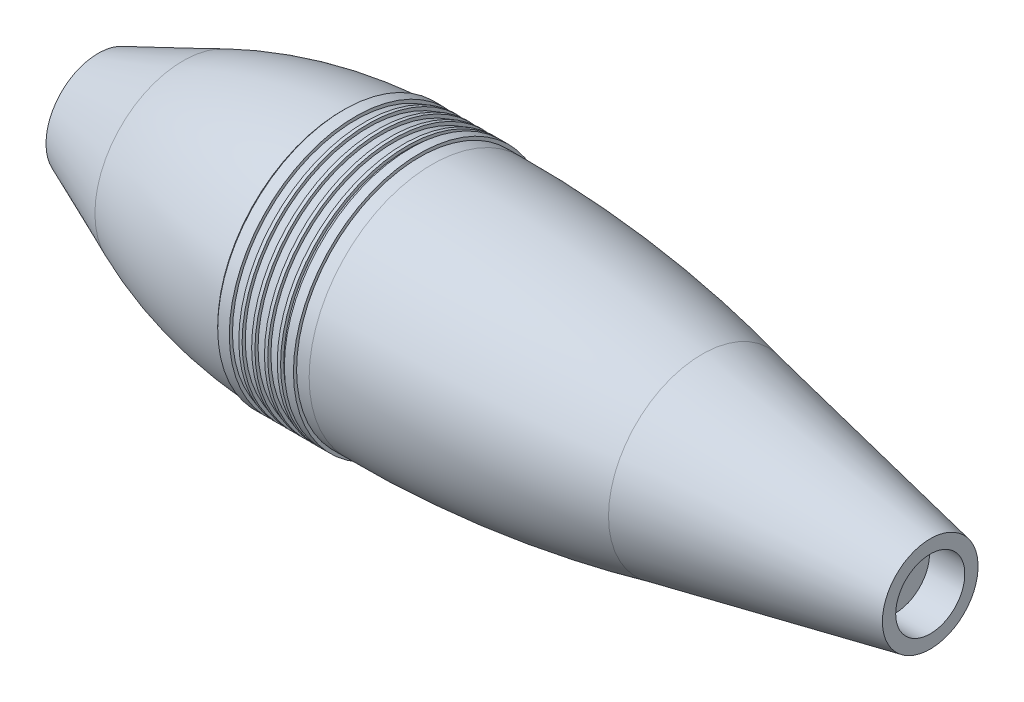
ISO-10303-21;
HEADER;
FILE_DESCRIPTION(('STEP AP214'),'2;1');
FILE_NAME('part.step','',(''),(''),'','','');
FILE_SCHEMA(('AUTOMOTIVE_DESIGN { 1 0 10303 214 1 1 1 1 }'));
ENDSEC;
DATA;
#1=APPLICATION_CONTEXT('core data for automotive mechanical design processes');
#2=APPLICATION_PROTOCOL_DEFINITION('international standard','automotive_design',2000,#1);
#3=PRODUCT_CONTEXT('',#1,'mechanical');
#4=PRODUCT('Part','Part','',(#3));
#5=PRODUCT_RELATED_PRODUCT_CATEGORY('part','',(#4));
#6=PRODUCT_DEFINITION_FORMATION('','',#4);
#7=PRODUCT_DEFINITION_CONTEXT('part definition',#1,'design');
#8=PRODUCT_DEFINITION('design','',#6,#7);
#9=PRODUCT_DEFINITION_SHAPE('','',#8);
#10=(LENGTH_UNIT() NAMED_UNIT(*) SI_UNIT(.MILLI.,.METRE.));
#11=(NAMED_UNIT(*) PLANE_ANGLE_UNIT() SI_UNIT($,.RADIAN.));
#12=(NAMED_UNIT(*) SI_UNIT($,.STERADIAN.) SOLID_ANGLE_UNIT());
#13=UNCERTAINTY_MEASURE_WITH_UNIT(LENGTH_MEASURE(1.E-05),#10,'distance_accuracy_value','');
#14=(GEOMETRIC_REPRESENTATION_CONTEXT(3) GLOBAL_UNCERTAINTY_ASSIGNED_CONTEXT((#13)) GLOBAL_UNIT_ASSIGNED_CONTEXT((#10,
#11,#12)) REPRESENTATION_CONTEXT('',''));
#15=CARTESIAN_POINT('',(0.,0.,0.));
#16=DIRECTION('',(0.,0.,1.));
#17=DIRECTION('',(1.,0.,0.));
#18=AXIS2_PLACEMENT_3D('',#15,#16,#17);
#19=CARTESIAN_POINT('',(-198.645,24.89,0.));
#20=DIRECTION('',(1.,0.,0.));
#21=DIRECTION('',(0.,0.,-1.));
#22=AXIS2_PLACEMENT_3D('',#19,#20,#21);
#23=PLANE('',#22);
#24=CARTESIAN_POINT('',(-198.645,0.,0.));
#25=DIRECTION('',(-1.,0.,0.));
#26=DIRECTION('',(0.,0.,1.));
#27=AXIS2_PLACEMENT_3D('',#24,#25,#26);
#28=CIRCLE('',#27,14.5);
#29=CARTESIAN_POINT('',(-198.645,0.,14.5));
#30=VERTEX_POINT('',#29);
#31=EDGE_CURVE('E10',#30,#30,#28,.T.);
#32=ORIENTED_EDGE('',*,*,#31,.F.);
#33=EDGE_LOOP('',(#32));
#34=FACE_BOUND('',#33,.T.);
#35=CARTESIAN_POINT('',(-198.645,0.,0.));
#36=DIRECTION('',(-1.,0.,0.));
#37=DIRECTION('',(0.,0.,1.));
#38=AXIS2_PLACEMENT_3D('',#35,#36,#37);
#39=CIRCLE('',#38,24.89);
#40=CARTESIAN_POINT('',(-198.645,0.,24.89));
#41=VERTEX_POINT('',#40);
#42=EDGE_CURVE('E139',#41,#41,#39,.T.);
#43=ORIENTED_EDGE('',*,*,#42,.T.);
#44=EDGE_LOOP('',(#43));
#45=FACE_BOUND('',#44,.T.);
#46=ADVANCED_FACE('F30',(#34,#45),#23,.F.);
#47=CARTESIAN_POINT('',(-198.645,0.,0.));
#48=DIRECTION('',(-1.,0.,0.));
#49=DIRECTION('',(0.,0.,1.));
#50=AXIS2_PLACEMENT_3D('',#47,#48,#49);
#51=CYLINDRICAL_SURFACE('',#50,14.5);
#52=CARTESIAN_POINT('',(-182.645,0.,0.));
#53=DIRECTION('',(-1.,0.,0.));
#54=DIRECTION('',(0.,0.,1.));
#55=AXIS2_PLACEMENT_3D('',#52,#53,#54);
#56=CIRCLE('',#55,14.5);
#57=CARTESIAN_POINT('',(-182.645,0.,14.5));
#58=VERTEX_POINT('',#57);
#59=EDGE_CURVE('E36',#58,#58,#56,.T.);
#60=ORIENTED_EDGE('',*,*,#59,.F.);
#61=EDGE_LOOP('',(#60));
#62=FACE_BOUND('',#61,.T.);
#63=ORIENTED_EDGE('',*,*,#31,.T.);
#64=EDGE_LOOP('',(#63));
#65=FACE_BOUND('',#64,.T.);
#66=ADVANCED_FACE('F305',(#62,#65),#51,.F.);
#67=CARTESIAN_POINT('',(-182.645,14.5,0.));
#68=DIRECTION('',(-1.,0.,0.));
#69=DIRECTION('',(0.,0.,1.));
#70=AXIS2_PLACEMENT_3D('',#67,#68,#69);
#71=PLANE('',#70);
#72=CARTESIAN_POINT('',(-182.645,0.,0.));
#73=DIRECTION('',(-1.,0.,0.));
#74=DIRECTION('',(0.,0.,1.));
#75=AXIS2_PLACEMENT_3D('',#72,#73,#74);
#76=CIRCLE('',#75,17.3451284403013);
#77=CARTESIAN_POINT('',(-182.645,0.,17.3451284403013));
#78=VERTEX_POINT('',#77);
#79=EDGE_CURVE('E40',#78,#78,#76,.T.);
#80=ORIENTED_EDGE('',*,*,#79,.F.);
#81=EDGE_LOOP('',(#80));
#82=FACE_BOUND('',#81,.T.);
#83=ORIENTED_EDGE('',*,*,#59,.T.);
#84=EDGE_LOOP('',(#83));
#85=FACE_BOUND('',#84,.T.);
#86=ADVANCED_FACE('F310',(#82,#85),#71,.F.);
#87=CARTESIAN_POINT('',(-180.445,0.,0.));
#88=DIRECTION('',(-1.,0.,0.));
#89=DIRECTION('',(0.,0.,1.));
#90=AXIS2_PLACEMENT_3D('',#87,#88,#89);
#91=TOROIDAL_SURFACE('',#90,17.3451284403013,2.20000000000001);
#92=CARTESIAN_POINT('',(-181.597791569387,0.,0.));
#93=DIRECTION('',(-1.,0.,0.));
#94=DIRECTION('',(0.,0.,1.));
#95=AXIS2_PLACEMENT_3D('',#92,#93,#94);
#96=CIRCLE('',#95,19.2189138062254);
#97=CARTESIAN_POINT('',(-181.597791569387,0.,19.2189138062254));
#98=VERTEX_POINT('',#97);
#99=EDGE_CURVE('E44',#98,#98,#96,.T.);
#100=ORIENTED_EDGE('',*,*,#99,.F.);
#101=EDGE_LOOP('',(#100));
#102=FACE_BOUND('',#101,.T.);
#103=ORIENTED_EDGE('',*,*,#79,.T.);
#104=EDGE_LOOP('',(#103));
#105=FACE_BOUND('',#104,.T.);
#106=ADVANCED_FACE('F315',(#102,#105),#91,.F.);
#107=CARTESIAN_POINT('',(-81.1844059141401,0.,0.));
#108=DIRECTION('',(-1.,0.,0.));
#109=DIRECTION('',(0.,0.,1.));
#110=AXIS2_PLACEMENT_3D('',#107,#108,#109);
#111=DEGENERATE_TOROIDAL_SURFACE('',#110,143.996308771973,191.63,.F.);
#112=CARTESIAN_POINT('',(-79.995,0.,0.));
#113=DIRECTION('',(-1.,0.,0.));
#114=DIRECTION('',(0.,0.,1.));
#115=AXIS2_PLACEMENT_3D('',#112,#113,#114);
#116=CIRCLE('',#115,47.63);
#117=CARTESIAN_POINT('',(-79.995,0.,47.63));
#118=VERTEX_POINT('',#117);
#119=EDGE_CURVE('E49',#118,#118,#116,.T.);
#120=ORIENTED_EDGE('',*,*,#119,.F.);
#121=EDGE_LOOP('',(#120));
#122=FACE_BOUND('',#121,.T.);
#123=ORIENTED_EDGE('',*,*,#99,.T.);
#124=EDGE_LOOP('',(#123));
#125=FACE_BOUND('',#124,.T.);
#126=ADVANCED_FACE('F321',(#122,#125),#111,.T.);
#127=CARTESIAN_POINT('',(-198.645,0.,0.));
#128=DIRECTION('',(-1.,0.,0.));
#129=DIRECTION('',(0.,0.,1.));
#130=AXIS2_PLACEMENT_3D('',#127,#128,#129);
#131=CYLINDRICAL_SURFACE('',#130,47.63);
#132=CARTESIAN_POINT('',(-10.775,0.,0.));
#133=DIRECTION('',(-1.,0.,0.));
#134=DIRECTION('',(0.,0.,1.));
#135=AXIS2_PLACEMENT_3D('',#132,#133,#134);
#136=CIRCLE('',#135,47.6300000000001);
#137=CARTESIAN_POINT('',(-10.775,0.,47.6300000000001));
#138=VERTEX_POINT('',#137);
#139=EDGE_CURVE('E52',#138,#138,#136,.T.);
#140=ORIENTED_EDGE('',*,*,#139,.F.);
#141=EDGE_LOOP('',(#140));
#142=FACE_BOUND('',#141,.T.);
#143=ORIENTED_EDGE('',*,*,#119,.T.);
#144=EDGE_LOOP('',(#143));
#145=FACE_BOUND('',#144,.T.);
#146=ADVANCED_FACE('F325',(#142,#145),#131,.F.);
#147=CARTESIAN_POINT('',(-30.7217353090551,0.,0.));
#148=DIRECTION('',(-1.,0.,0.));
#149=DIRECTION('',(0.,0.,1.));
#150=AXIS2_PLACEMENT_3D('',#147,#148,#149);
#151=DEGENERATE_TOROIDAL_SURFACE('',#150,576.161166858357,624.11,.F.);
#152=CARTESIAN_POINT('',(89.705,0.,0.));
#153=DIRECTION('',(-1.,0.,0.));
#154=DIRECTION('',(0.,0.,1.));
#155=AXIS2_PLACEMENT_3D('',#152,#153,#154);
#156=CIRCLE('',#155,36.22);
#157=CARTESIAN_POINT('',(89.705,0.,36.22));
#158=VERTEX_POINT('',#157);
#159=EDGE_CURVE('E55',#158,#158,#156,.T.);
#160=ORIENTED_EDGE('',*,*,#159,.F.);
#161=EDGE_LOOP('',(#160));
#162=FACE_BOUND('',#161,.T.);
#163=ORIENTED_EDGE('',*,*,#139,.T.);
#164=EDGE_LOOP('',(#163));
#165=FACE_BOUND('',#164,.T.);
#166=ADVANCED_FACE('F329',(#162,#165),#151,.T.);
#167=CARTESIAN_POINT('',(89.705,0.,0.));
#168=DIRECTION('',(-1.,0.,0.));
#169=DIRECTION('',(0.,0.,1.));
#170=AXIS2_PLACEMENT_3D('',#167,#168,#169);
#171=CONICAL_SURFACE('',#170,36.22,0.235452955616675);
#172=CARTESIAN_POINT('',(164.237834674445,0.,0.));
#173=DIRECTION('',(-1.,0.,0.));
#174=DIRECTION('',(0.,0.,1.));
#175=AXIS2_PLACEMENT_3D('',#172,#173,#174);
#176=CIRCLE('',#175,18.3393734819945);
#177=CARTESIAN_POINT('',(164.237834674445,0.,18.3393734819945));
#178=VERTEX_POINT('',#177);
#179=EDGE_CURVE('E58',#178,#178,#176,.T.);
#180=ORIENTED_EDGE('',*,*,#179,.F.);
#181=EDGE_LOOP('',(#180));
#182=FACE_BOUND('',#181,.T.);
#183=ORIENTED_EDGE('',*,*,#159,.T.);
#184=EDGE_LOOP('',(#183));
#185=FACE_BOUND('',#184,.T.);
#186=ADVANCED_FACE('F333',(#182,#185),#171,.F.);
#187=CARTESIAN_POINT('',(161.905,0.,0.));
#188=DIRECTION('',(-1.,0.,0.));
#189=DIRECTION('',(0.,0.,1.));
#190=AXIS2_PLACEMENT_3D('',#187,#188,#189);
#191=DEGENERATE_TOROIDAL_SURFACE('',#190,8.61528574166081,10.,.T.);
#192=CARTESIAN_POINT('',(171.905,0.,0.));
#193=DIRECTION('',(-1.,0.,0.));
#194=DIRECTION('',(0.,0.,1.));
#195=AXIS2_PLACEMENT_3D('',#192,#193,#194);
#196=CIRCLE('',#195,8.61528574166075);
#197=CARTESIAN_POINT('',(171.905,0.,8.61528574166075));
#198=VERTEX_POINT('',#197);
#199=EDGE_CURVE('E61',#198,#198,#196,.T.);
#200=ORIENTED_EDGE('',*,*,#199,.F.);
#201=EDGE_LOOP('',(#200));
#202=FACE_BOUND('',#201,.T.);
#203=ORIENTED_EDGE('',*,*,#179,.T.);
#204=EDGE_LOOP('',(#203));
#205=FACE_BOUND('',#204,.T.);
#206=ADVANCED_FACE('F301',(#202,#205),#191,.F.);
#207=CARTESIAN_POINT('',(171.905,0.,0.));
#208=DIRECTION('',(1.,0.,0.));
#209=DIRECTION('',(0.,0.,-1.));
#210=AXIS2_PLACEMENT_3D('',#207,#208,#209);
#211=PLANE('',#210);
#212=ORIENTED_EDGE('',*,*,#199,.T.);
#213=EDGE_LOOP('',(#212));
#214=FACE_BOUND('',#213,.T.);
#215=ADVANCED_FACE('F296',(#214),#211,.F.);
#216=CARTESIAN_POINT('',(181.815,16.5,0.));
#217=DIRECTION('',(-1.,0.,0.));
#218=DIRECTION('',(0.,0.,1.));
#219=AXIS2_PLACEMENT_3D('',#216,#217,#218);
#220=PLANE('',#219);
#221=CARTESIAN_POINT('',(181.815,0.,0.));
#222=DIRECTION('',(-1.,0.,0.));
#223=DIRECTION('',(0.,0.,1.));
#224=AXIS2_PLACEMENT_3D('',#221,#222,#223);
#225=CIRCLE('',#224,16.5);
#226=CARTESIAN_POINT('',(181.815,0.,16.5));
#227=VERTEX_POINT('',#226);
#228=EDGE_CURVE('E64',#227,#227,#225,.T.);
#229=ORIENTED_EDGE('',*,*,#228,.F.);
#230=EDGE_LOOP('',(#229));
#231=FACE_BOUND('',#230,.T.);
#232=ADVANCED_FACE('F291',(#231),#220,.F.);
#233=CARTESIAN_POINT('',(-198.645,0.,0.));
#234=DIRECTION('',(-1.,0.,0.));
#235=DIRECTION('',(0.,0.,1.));
#236=AXIS2_PLACEMENT_3D('',#233,#234,#235);
#237=CYLINDRICAL_SURFACE('',#236,16.5);
#238=CARTESIAN_POINT('',(198.645,0.,0.));
#239=DIRECTION('',(-1.,0.,0.));
#240=DIRECTION('',(0.,0.,1.));
#241=AXIS2_PLACEMENT_3D('',#238,#239,#240);
#242=CIRCLE('',#241,16.5);
#243=CARTESIAN_POINT('',(198.645,0.,16.5));
#244=VERTEX_POINT('',#243);
#245=EDGE_CURVE('E67',#244,#244,#242,.T.);
#246=ORIENTED_EDGE('',*,*,#245,.F.);
#247=EDGE_LOOP('',(#246));
#248=FACE_BOUND('',#247,.T.);
#249=ORIENTED_EDGE('',*,*,#228,.T.);
#250=EDGE_LOOP('',(#249));
#251=FACE_BOUND('',#250,.T.);
#252=ADVANCED_FACE('F285',(#248,#251),#237,.F.);
#253=CARTESIAN_POINT('',(198.645,22.84,0.));
#254=DIRECTION('',(-1.,0.,0.));
#255=DIRECTION('',(0.,0.,1.));
#256=AXIS2_PLACEMENT_3D('',#253,#254,#255);
#257=PLANE('',#256);
#258=CARTESIAN_POINT('',(198.645,0.,0.));
#259=DIRECTION('',(-1.,0.,0.));
#260=DIRECTION('',(0.,0.,1.));
#261=AXIS2_PLACEMENT_3D('',#258,#259,#260);
#262=CIRCLE('',#261,22.84);
#263=CARTESIAN_POINT('',(198.645,0.,22.84));
#264=VERTEX_POINT('',#263);
#265=EDGE_CURVE('E70',#264,#264,#262,.T.);
#266=ORIENTED_EDGE('',*,*,#265,.F.);
#267=EDGE_LOOP('',(#266));
#268=FACE_BOUND('',#267,.T.);
#269=ORIENTED_EDGE('',*,*,#245,.T.);
#270=EDGE_LOOP('',(#269));
#271=FACE_BOUND('',#270,.T.);
#272=ADVANCED_FACE('F279',(#268,#271),#257,.F.);
#273=CARTESIAN_POINT('',(198.645,0.,0.));
#274=DIRECTION('',(-1.,0.,0.));
#275=DIRECTION('',(0.,0.,1.));
#276=AXIS2_PLACEMENT_3D('',#273,#274,#275);
#277=CONICAL_SURFACE('',#276,22.84,0.197766237466921);
#278=CARTESIAN_POINT('',(89.705,0.,0.));
#279=DIRECTION('',(-1.,0.,0.));
#280=DIRECTION('',(0.,0.,1.));
#281=AXIS2_PLACEMENT_3D('',#278,#279,#280);
#282=CIRCLE('',#281,44.67);
#283=CARTESIAN_POINT('',(89.705,0.,44.67));
#284=VERTEX_POINT('',#283);
#285=EDGE_CURVE('E73',#284,#284,#282,.T.);
#286=ORIENTED_EDGE('',*,*,#285,.F.);
#287=EDGE_LOOP('',(#286));
#288=FACE_BOUND('',#287,.T.);
#289=ORIENTED_EDGE('',*,*,#265,.T.);
#290=EDGE_LOOP('',(#289));
#291=FACE_BOUND('',#290,.T.);
#292=ADVANCED_FACE('F273',(#288,#291),#277,.T.);
#293=CARTESIAN_POINT('',(-35.254257253578,0.,0.));
#294=DIRECTION('',(-1.,0.,0.));
#295=DIRECTION('',(0.,0.,1.));
#296=AXIS2_PLACEMENT_3D('',#293,#294,#295);
#297=DEGENERATE_TOROIDAL_SURFACE('',#296,501.661563820574,560.44,.F.);
#298=CARTESIAN_POINT('',(-39.135,0.,0.));
#299=DIRECTION('',(-1.,0.,0.));
#300=DIRECTION('',(0.,0.,1.));
#301=AXIS2_PLACEMENT_3D('',#298,#299,#300);
#302=CIRCLE('',#301,58.765);
#303=CARTESIAN_POINT('',(-39.135,0.,58.765));
#304=VERTEX_POINT('',#303);
#305=EDGE_CURVE('E76',#304,#304,#302,.T.);
#306=ORIENTED_EDGE('',*,*,#305,.F.);
#307=EDGE_LOOP('',(#306));
#308=FACE_BOUND('',#307,.T.);
#309=ORIENTED_EDGE('',*,*,#285,.T.);
#310=EDGE_LOOP('',(#309));
#311=FACE_BOUND('',#310,.T.);
#312=ADVANCED_FACE('F267',(#308,#311),#297,.F.);
#313=CARTESIAN_POINT('',(-198.645,0.,0.));
#314=DIRECTION('',(-1.,0.,0.));
#315=DIRECTION('',(0.,0.,1.));
#316=AXIS2_PLACEMENT_3D('',#313,#314,#315);
#317=CYLINDRICAL_SURFACE('',#316,58.765);
#318=CARTESIAN_POINT('',(-45.135,0.,0.));
#319=DIRECTION('',(-1.,0.,0.));
#320=DIRECTION('',(0.,0.,1.));
#321=AXIS2_PLACEMENT_3D('',#318,#319,#320);
#322=CIRCLE('',#321,58.765);
#323=CARTESIAN_POINT('',(-45.135,0.,58.765));
#324=VERTEX_POINT('',#323);
#325=EDGE_CURVE('E79',#324,#324,#322,.T.);
#326=ORIENTED_EDGE('',*,*,#325,.F.);
#327=EDGE_LOOP('',(#326));
#328=FACE_BOUND('',#327,.T.);
#329=ORIENTED_EDGE('',*,*,#305,.T.);
#330=EDGE_LOOP('',(#329));
#331=FACE_BOUND('',#330,.T.);
#332=ADVANCED_FACE('F261',(#328,#331),#317,.T.);
#333=CARTESIAN_POINT('',(-45.135,60.27,0.));
#334=DIRECTION('',(-1.,0.,0.));
#335=DIRECTION('',(0.,0.,1.));
#336=AXIS2_PLACEMENT_3D('',#333,#334,#335);
#337=PLANE('',#336);
#338=CARTESIAN_POINT('',(-45.135,0.,0.));
#339=DIRECTION('',(-1.,0.,0.));
#340=DIRECTION('',(0.,0.,1.));
#341=AXIS2_PLACEMENT_3D('',#338,#339,#340);
#342=CIRCLE('',#341,60.27);
#343=CARTESIAN_POINT('',(-45.135,0.,60.27));
#344=VERTEX_POINT('',#343);
#345=EDGE_CURVE('E82',#344,#344,#342,.T.);
#346=ORIENTED_EDGE('',*,*,#345,.F.);
#347=EDGE_LOOP('',(#346));
#348=FACE_BOUND('',#347,.T.);
#349=ORIENTED_EDGE('',*,*,#325,.T.);
#350=EDGE_LOOP('',(#349));
#351=FACE_BOUND('',#350,.T.);
#352=ADVANCED_FACE('F255',(#348,#351),#337,.F.);
#353=CARTESIAN_POINT('',(-198.645,0.,0.));
#354=DIRECTION('',(-1.,0.,0.));
#355=DIRECTION('',(0.,0.,1.));
#356=AXIS2_PLACEMENT_3D('',#353,#354,#355);
#357=CYLINDRICAL_SURFACE('',#356,60.27);
#358=CARTESIAN_POINT('',(-49.475,0.,0.));
#359=DIRECTION('',(-1.,0.,0.));
#360=DIRECTION('',(0.,0.,1.));
#361=AXIS2_PLACEMENT_3D('',#358,#359,#360);
#362=CIRCLE('',#361,60.27);
#363=CARTESIAN_POINT('',(-49.475,0.,60.27));
#364=VERTEX_POINT('',#363);
#365=EDGE_CURVE('E85',#364,#364,#362,.T.);
#366=ORIENTED_EDGE('',*,*,#365,.F.);
#367=EDGE_LOOP('',(#366));
#368=FACE_BOUND('',#367,.T.);
#369=ORIENTED_EDGE('',*,*,#345,.T.);
#370=EDGE_LOOP('',(#369));
#371=FACE_BOUND('',#370,.T.);
#372=ADVANCED_FACE('F249',(#368,#371),#357,.T.);
#373=CARTESIAN_POINT('',(-49.475,0.,0.));
#374=DIRECTION('',(1.,0.,0.));
#375=DIRECTION('',(0.,0.,-1.));
#376=AXIS2_PLACEMENT_3D('',#373,#374,#375);
#377=CONICAL_SURFACE('',#376,60.27,0.696375382510421);
#378=CARTESIAN_POINT('',(-51.275,0.,0.));
#379=DIRECTION('',(-1.,0.,0.));
#380=DIRECTION('',(0.,0.,1.));
#381=AXIS2_PLACEMENT_3D('',#378,#379,#380);
#382=CIRCLE('',#381,58.765);
#383=CARTESIAN_POINT('',(-51.275,0.,58.765));
#384=VERTEX_POINT('',#383);
#385=EDGE_CURVE('E88',#384,#384,#382,.T.);
#386=ORIENTED_EDGE('',*,*,#385,.F.);
#387=EDGE_LOOP('',(#386));
#388=FACE_BOUND('',#387,.T.);
#389=ORIENTED_EDGE('',*,*,#365,.T.);
#390=EDGE_LOOP('',(#389));
#391=FACE_BOUND('',#390,.T.);
#392=ADVANCED_FACE('F243',(#388,#391),#377,.T.);
#393=CARTESIAN_POINT('',(-51.275,60.27,0.));
#394=DIRECTION('',(-1.,0.,0.));
#395=DIRECTION('',(0.,0.,1.));
#396=AXIS2_PLACEMENT_3D('',#393,#394,#395);
#397=PLANE('',#396);
#398=CARTESIAN_POINT('',(-51.275,0.,0.));
#399=DIRECTION('',(-1.,0.,0.));
#400=DIRECTION('',(0.,0.,1.));
#401=AXIS2_PLACEMENT_3D('',#398,#399,#400);
#402=CIRCLE('',#401,60.27);
#403=CARTESIAN_POINT('',(-51.275,0.,60.27));
#404=VERTEX_POINT('',#403);
#405=EDGE_CURVE('E91',#404,#404,#402,.T.);
#406=ORIENTED_EDGE('',*,*,#405,.F.);
#407=EDGE_LOOP('',(#406));
#408=FACE_BOUND('',#407,.T.);
#409=ORIENTED_EDGE('',*,*,#385,.T.);
#410=EDGE_LOOP('',(#409));
#411=FACE_BOUND('',#410,.T.);
#412=ADVANCED_FACE('F237',(#408,#411),#397,.F.);
#413=CARTESIAN_POINT('',(-198.645,0.,0.));
#414=DIRECTION('',(-1.,0.,0.));
#415=DIRECTION('',(0.,0.,1.));
#416=AXIS2_PLACEMENT_3D('',#413,#414,#415);
#417=CYLINDRICAL_SURFACE('',#416,60.27);
#418=CARTESIAN_POINT('',(-52.855,0.,0.));
#419=DIRECTION('',(-1.,0.,0.));
#420=DIRECTION('',(0.,0.,1.));
#421=AXIS2_PLACEMENT_3D('',#418,#419,#420);
#422=CIRCLE('',#421,60.27);
#423=CARTESIAN_POINT('',(-52.855,0.,60.27));
#424=VERTEX_POINT('',#423);
#425=EDGE_CURVE('E94',#424,#424,#422,.T.);
#426=ORIENTED_EDGE('',*,*,#425,.F.);
#427=EDGE_LOOP('',(#426));
#428=FACE_BOUND('',#427,.T.);
#429=ORIENTED_EDGE('',*,*,#405,.T.);
#430=EDGE_LOOP('',(#429));
#431=FACE_BOUND('',#430,.T.);
#432=ADVANCED_FACE('F231',(#428,#431),#417,.T.);
#433=CARTESIAN_POINT('',(-52.855,0.,0.));
#434=DIRECTION('',(1.,0.,0.));
#435=DIRECTION('',(0.,0.,-1.));
#436=AXIS2_PLACEMENT_3D('',#433,#434,#435);
#437=CONICAL_SURFACE('',#436,60.27,0.32009766333992);
#438=CARTESIAN_POINT('',(-57.395,0.,0.));
#439=DIRECTION('',(-1.,0.,0.));
#440=DIRECTION('',(0.,0.,1.));
#441=AXIS2_PLACEMENT_3D('',#438,#439,#440);
#442=CIRCLE('',#441,58.765);
#443=CARTESIAN_POINT('',(-57.395,0.,58.765));
#444=VERTEX_POINT('',#443);
#445=EDGE_CURVE('E97',#444,#444,#442,.T.);
#446=ORIENTED_EDGE('',*,*,#445,.F.);
#447=EDGE_LOOP('',(#446));
#448=FACE_BOUND('',#447,.T.);
#449=ORIENTED_EDGE('',*,*,#425,.T.);
#450=EDGE_LOOP('',(#449));
#451=FACE_BOUND('',#450,.T.);
#452=ADVANCED_FACE('F225',(#448,#451),#437,.T.);
#453=CARTESIAN_POINT('',(-57.395,60.27,0.));
#454=DIRECTION('',(-1.,0.,0.));
#455=DIRECTION('',(0.,0.,1.));
#456=AXIS2_PLACEMENT_3D('',#453,#454,#455);
#457=PLANE('',#456);
#458=CARTESIAN_POINT('',(-57.395,0.,0.));
#459=DIRECTION('',(-1.,0.,0.));
#460=DIRECTION('',(0.,0.,1.));
#461=AXIS2_PLACEMENT_3D('',#458,#459,#460);
#462=CIRCLE('',#461,60.27);
#463=CARTESIAN_POINT('',(-57.395,0.,60.27));
#464=VERTEX_POINT('',#463);
#465=EDGE_CURVE('E100',#464,#464,#462,.T.);
#466=ORIENTED_EDGE('',*,*,#465,.F.);
#467=EDGE_LOOP('',(#466));
#468=FACE_BOUND('',#467,.T.);
#469=ORIENTED_EDGE('',*,*,#445,.T.);
#470=EDGE_LOOP('',(#469));
#471=FACE_BOUND('',#470,.T.);
#472=ADVANCED_FACE('F219',(#468,#471),#457,.F.);
#473=CARTESIAN_POINT('',(-198.645,0.,0.));
#474=DIRECTION('',(-1.,0.,0.));
#475=DIRECTION('',(0.,0.,1.));
#476=AXIS2_PLACEMENT_3D('',#473,#474,#475);
#477=CYLINDRICAL_SURFACE('',#476,60.27);
#478=CARTESIAN_POINT('',(-58.975,0.,0.));
#479=DIRECTION('',(-1.,0.,0.));
#480=DIRECTION('',(0.,0.,1.));
#481=AXIS2_PLACEMENT_3D('',#478,#479,#480);
#482=CIRCLE('',#481,60.27);
#483=CARTESIAN_POINT('',(-58.975,0.,60.27));
#484=VERTEX_POINT('',#483);
#485=EDGE_CURVE('E103',#484,#484,#482,.T.);
#486=ORIENTED_EDGE('',*,*,#485,.F.);
#487=EDGE_LOOP('',(#486));
#488=FACE_BOUND('',#487,.T.);
#489=ORIENTED_EDGE('',*,*,#465,.T.);
#490=EDGE_LOOP('',(#489));
#491=FACE_BOUND('',#490,.T.);
#492=ADVANCED_FACE('F213',(#488,#491),#477,.T.);
#493=CARTESIAN_POINT('',(-58.975,0.,0.));
#494=DIRECTION('',(1.,0.,0.));
#495=DIRECTION('',(0.,0.,-1.));
#496=AXIS2_PLACEMENT_3D('',#493,#494,#495);
#497=CONICAL_SURFACE('',#496,60.27,0.32009766333992);
#498=CARTESIAN_POINT('',(-63.515,0.,0.));
#499=DIRECTION('',(-1.,0.,0.));
#500=DIRECTION('',(0.,0.,1.));
#501=AXIS2_PLACEMENT_3D('',#498,#499,#500);
#502=CIRCLE('',#501,58.765);
#503=CARTESIAN_POINT('',(-63.515,0.,58.765));
#504=VERTEX_POINT('',#503);
#505=EDGE_CURVE('E106',#504,#504,#502,.T.);
#506=ORIENTED_EDGE('',*,*,#505,.F.);
#507=EDGE_LOOP('',(#506));
#508=FACE_BOUND('',#507,.T.);
#509=ORIENTED_EDGE('',*,*,#485,.T.);
#510=EDGE_LOOP('',(#509));
#511=FACE_BOUND('',#510,.T.);
#512=ADVANCED_FACE('F207',(#508,#511),#497,.T.);
#513=CARTESIAN_POINT('',(-63.515,60.27,0.));
#514=DIRECTION('',(-1.,0.,0.));
#515=DIRECTION('',(0.,0.,1.));
#516=AXIS2_PLACEMENT_3D('',#513,#514,#515);
#517=PLANE('',#516);
#518=CARTESIAN_POINT('',(-63.515,0.,0.));
#519=DIRECTION('',(-1.,0.,0.));
#520=DIRECTION('',(0.,0.,1.));
#521=AXIS2_PLACEMENT_3D('',#518,#519,#520);
#522=CIRCLE('',#521,60.27);
#523=CARTESIAN_POINT('',(-63.515,0.,60.27));
#524=VERTEX_POINT('',#523);
#525=EDGE_CURVE('E109',#524,#524,#522,.T.);
#526=ORIENTED_EDGE('',*,*,#525,.F.);
#527=EDGE_LOOP('',(#526));
#528=FACE_BOUND('',#527,.T.);
#529=ORIENTED_EDGE('',*,*,#505,.T.);
#530=EDGE_LOOP('',(#529));
#531=FACE_BOUND('',#530,.T.);
#532=ADVANCED_FACE('F201',(#528,#531),#517,.F.);
#533=CARTESIAN_POINT('',(-198.645,0.,0.));
#534=DIRECTION('',(-1.,0.,0.));
#535=DIRECTION('',(0.,0.,1.));
#536=AXIS2_PLACEMENT_3D('',#533,#534,#535);
#537=CYLINDRICAL_SURFACE('',#536,60.27);
#538=CARTESIAN_POINT('',(-65.095,0.,0.));
#539=DIRECTION('',(-1.,0.,0.));
#540=DIRECTION('',(0.,0.,1.));
#541=AXIS2_PLACEMENT_3D('',#538,#539,#540);
#542=CIRCLE('',#541,60.27);
#543=CARTESIAN_POINT('',(-65.095,0.,60.27));
#544=VERTEX_POINT('',#543);
#545=EDGE_CURVE('E112',#544,#544,#542,.T.);
#546=ORIENTED_EDGE('',*,*,#545,.F.);
#547=EDGE_LOOP('',(#546));
#548=FACE_BOUND('',#547,.T.);
#549=ORIENTED_EDGE('',*,*,#525,.T.);
#550=EDGE_LOOP('',(#549));
#551=FACE_BOUND('',#550,.T.);
#552=ADVANCED_FACE('F195',(#548,#551),#537,.T.);
#553=CARTESIAN_POINT('',(-65.095,0.,0.));
#554=DIRECTION('',(1.,0.,0.));
#555=DIRECTION('',(0.,0.,-1.));
#556=AXIS2_PLACEMENT_3D('',#553,#554,#555);
#557=CONICAL_SURFACE('',#556,60.27,0.320097663339922);
#558=CARTESIAN_POINT('',(-69.635,0.,0.));
#559=DIRECTION('',(-1.,0.,0.));
#560=DIRECTION('',(0.,0.,1.));
#561=AXIS2_PLACEMENT_3D('',#558,#559,#560);
#562=CIRCLE('',#561,58.765);
#563=CARTESIAN_POINT('',(-69.635,0.,58.765));
#564=VERTEX_POINT('',#563);
#565=EDGE_CURVE('E115',#564,#564,#562,.T.);
#566=ORIENTED_EDGE('',*,*,#565,.F.);
#567=EDGE_LOOP('',(#566));
#568=FACE_BOUND('',#567,.T.);
#569=ORIENTED_EDGE('',*,*,#545,.T.);
#570=EDGE_LOOP('',(#569));
#571=FACE_BOUND('',#570,.T.);
#572=ADVANCED_FACE('F189',(#568,#571),#557,.T.);
#573=CARTESIAN_POINT('',(-69.635,60.27,0.));
#574=DIRECTION('',(-1.,0.,0.));
#575=DIRECTION('',(0.,0.,1.));
#576=AXIS2_PLACEMENT_3D('',#573,#574,#575);
#577=PLANE('',#576);
#578=CARTESIAN_POINT('',(-69.635,0.,0.));
#579=DIRECTION('',(-1.,0.,0.));
#580=DIRECTION('',(0.,0.,1.));
#581=AXIS2_PLACEMENT_3D('',#578,#579,#580);
#582=CIRCLE('',#581,60.27);
#583=CARTESIAN_POINT('',(-69.635,0.,60.27));
#584=VERTEX_POINT('',#583);
#585=EDGE_CURVE('E118',#584,#584,#582,.T.);
#586=ORIENTED_EDGE('',*,*,#585,.F.);
#587=EDGE_LOOP('',(#586));
#588=FACE_BOUND('',#587,.T.);
#589=ORIENTED_EDGE('',*,*,#565,.T.);
#590=EDGE_LOOP('',(#589));
#591=FACE_BOUND('',#590,.T.);
#592=ADVANCED_FACE('F183',(#588,#591),#577,.F.);
#593=CARTESIAN_POINT('',(-198.645,0.,0.));
#594=DIRECTION('',(-1.,0.,0.));
#595=DIRECTION('',(0.,0.,1.));
#596=AXIS2_PLACEMENT_3D('',#593,#594,#595);
#597=CYLINDRICAL_SURFACE('',#596,60.27);
#598=CARTESIAN_POINT('',(-71.215,0.,0.));
#599=DIRECTION('',(-1.,0.,0.));
#600=DIRECTION('',(0.,0.,1.));
#601=AXIS2_PLACEMENT_3D('',#598,#599,#600);
#602=CIRCLE('',#601,60.27);
#603=CARTESIAN_POINT('',(-71.215,0.,60.27));
#604=VERTEX_POINT('',#603);
#605=EDGE_CURVE('E121',#604,#604,#602,.T.);
#606=ORIENTED_EDGE('',*,*,#605,.F.);
#607=EDGE_LOOP('',(#606));
#608=FACE_BOUND('',#607,.T.);
#609=ORIENTED_EDGE('',*,*,#585,.T.);
#610=EDGE_LOOP('',(#609));
#611=FACE_BOUND('',#610,.T.);
#612=ADVANCED_FACE('F177',(#608,#611),#597,.T.);
#613=CARTESIAN_POINT('',(-71.215,0.,0.));
#614=DIRECTION('',(1.,0.,0.));
#615=DIRECTION('',(0.,0.,-1.));
#616=AXIS2_PLACEMENT_3D('',#613,#614,#615);
#617=CONICAL_SURFACE('',#616,60.27,0.320097663339922);
#618=CARTESIAN_POINT('',(-75.755,0.,0.));
#619=DIRECTION('',(-1.,0.,0.));
#620=DIRECTION('',(0.,0.,1.));
#621=AXIS2_PLACEMENT_3D('',#618,#619,#620);
#622=CIRCLE('',#621,58.765);
#623=CARTESIAN_POINT('',(-75.755,0.,58.765));
#624=VERTEX_POINT('',#623);
#625=EDGE_CURVE('E124',#624,#624,#622,.T.);
#626=ORIENTED_EDGE('',*,*,#625,.F.);
#627=EDGE_LOOP('',(#626));
#628=FACE_BOUND('',#627,.T.);
#629=ORIENTED_EDGE('',*,*,#605,.T.);
#630=EDGE_LOOP('',(#629));
#631=FACE_BOUND('',#630,.T.);
#632=ADVANCED_FACE('F171',(#628,#631),#617,.T.);
#633=CARTESIAN_POINT('',(-75.755,60.27,0.));
#634=DIRECTION('',(-1.,0.,0.));
#635=DIRECTION('',(0.,0.,1.));
#636=AXIS2_PLACEMENT_3D('',#633,#634,#635);
#637=PLANE('',#636);
#638=CARTESIAN_POINT('',(-75.755,0.,0.));
#639=DIRECTION('',(-1.,0.,0.));
#640=DIRECTION('',(0.,0.,1.));
#641=AXIS2_PLACEMENT_3D('',#638,#639,#640);
#642=CIRCLE('',#641,60.27);
#643=CARTESIAN_POINT('',(-75.755,0.,60.27));
#644=VERTEX_POINT('',#643);
#645=EDGE_CURVE('E127',#644,#644,#642,.T.);
#646=ORIENTED_EDGE('',*,*,#645,.F.);
#647=EDGE_LOOP('',(#646));
#648=FACE_BOUND('',#647,.T.);
#649=ORIENTED_EDGE('',*,*,#625,.T.);
#650=EDGE_LOOP('',(#649));
#651=FACE_BOUND('',#650,.T.);
#652=ADVANCED_FACE('F165',(#648,#651),#637,.F.);
#653=CARTESIAN_POINT('',(-198.645,0.,0.));
#654=DIRECTION('',(-1.,0.,0.));
#655=DIRECTION('',(0.,0.,1.));
#656=AXIS2_PLACEMENT_3D('',#653,#654,#655);
#657=CYLINDRICAL_SURFACE('',#656,60.27);
#658=CARTESIAN_POINT('',(-81.295,0.,0.));
#659=DIRECTION('',(-1.,0.,0.));
#660=DIRECTION('',(0.,0.,1.));
#661=AXIS2_PLACEMENT_3D('',#658,#659,#660);
#662=CIRCLE('',#661,60.27);
#663=CARTESIAN_POINT('',(-81.295,0.,60.27));
#664=VERTEX_POINT('',#663);
#665=EDGE_CURVE('E130',#664,#664,#662,.T.);
#666=ORIENTED_EDGE('',*,*,#665,.F.);
#667=EDGE_LOOP('',(#666));
#668=FACE_BOUND('',#667,.T.);
#669=ORIENTED_EDGE('',*,*,#645,.T.);
#670=EDGE_LOOP('',(#669));
#671=FACE_BOUND('',#670,.T.);
#672=ADVANCED_FACE('F159',(#668,#671),#657,.T.);
#673=CARTESIAN_POINT('',(-83.4905824957813,0.,0.));
#674=DIRECTION('',(-1.,0.,0.));
#675=DIRECTION('',(0.,0.,1.));
#676=AXIS2_PLACEMENT_3D('',#673,#674,#675);
#677=TOROIDAL_SURFACE('',#676,61.4655824957813,2.5);
#678=CARTESIAN_POINT('',(-82.295,0.,0.));
#679=DIRECTION('',(-1.,0.,0.));
#680=DIRECTION('',(0.,0.,1.));
#681=AXIS2_PLACEMENT_3D('',#678,#679,#680);
#682=CIRCLE('',#681,59.27);
#683=CARTESIAN_POINT('',(-82.295,0.,59.27));
#684=VERTEX_POINT('',#683);
#685=EDGE_CURVE('E133',#684,#684,#682,.T.);
#686=ORIENTED_EDGE('',*,*,#685,.F.);
#687=EDGE_LOOP('',(#686));
#688=FACE_BOUND('',#687,.T.);
#689=ORIENTED_EDGE('',*,*,#665,.T.);
#690=EDGE_LOOP('',(#689));
#691=FACE_BOUND('',#690,.T.);
#692=ADVANCED_FACE('F153',(#688,#691),#677,.F.);
#693=CARTESIAN_POINT('',(-72.7910716791743,0.,0.));
#694=DIRECTION('',(-1.,0.,0.));
#695=DIRECTION('',(0.,0.,1.));
#696=AXIS2_PLACEMENT_3D('',#693,#694,#695);
#697=DEGENERATE_TOROIDAL_SURFACE('',#696,158.672877485071,218.15,.F.);
#698=CARTESIAN_POINT('',(-158.065,0.,0.));
#699=DIRECTION('',(-1.,0.,0.));
#700=DIRECTION('',(0.,0.,1.));
#701=AXIS2_PLACEMENT_3D('',#698,#699,#700);
#702=CIRCLE('',#701,42.12);
#703=CARTESIAN_POINT('',(-158.065,0.,42.12));
#704=VERTEX_POINT('',#703);
#705=EDGE_CURVE('E136',#704,#704,#702,.T.);
#706=ORIENTED_EDGE('',*,*,#705,.F.);
#707=EDGE_LOOP('',(#706));
#708=FACE_BOUND('',#707,.T.);
#709=ORIENTED_EDGE('',*,*,#685,.T.);
#710=EDGE_LOOP('',(#709));
#711=FACE_BOUND('',#710,.T.);
#712=ADVANCED_FACE('F147',(#708,#711),#697,.F.);
#713=CARTESIAN_POINT('',(-158.065,0.,0.));
#714=DIRECTION('',(1.,0.,0.));
#715=DIRECTION('',(0.,0.,-1.));
#716=AXIS2_PLACEMENT_3D('',#713,#714,#715);
#717=CONICAL_SURFACE('',#716,42.12,0.401526199588351);
#718=ORIENTED_EDGE('',*,*,#42,.F.);
#719=EDGE_LOOP('',(#718));
#720=FACE_BOUND('',#719,.T.);
#721=ORIENTED_EDGE('',*,*,#705,.T.);
#722=EDGE_LOOP('',(#721));
#723=FACE_BOUND('',#722,.T.);
#724=ADVANCED_FACE('F144',(#720,#723),#717,.T.);
#725=CLOSED_SHELL('',(#46,#66,#86,#106,#126,#146,#166,#186,#206,#215,#232,#252,#272,#292,#312,
#332,#352,#372,#392,#412,#432,#452,#472,#492,#512,#532,#552,#572,#592,#612,#632,#652,#672,#692,
#712,#724));
#726=MANIFOLD_SOLID_BREP('B2',#725);
#727=ADVANCED_BREP_SHAPE_REPRESENTATION('',(#18,#726),#14);
#728=SHAPE_DEFINITION_REPRESENTATION(#9,#727);
ENDSEC;
END-ISO-10303-21;
